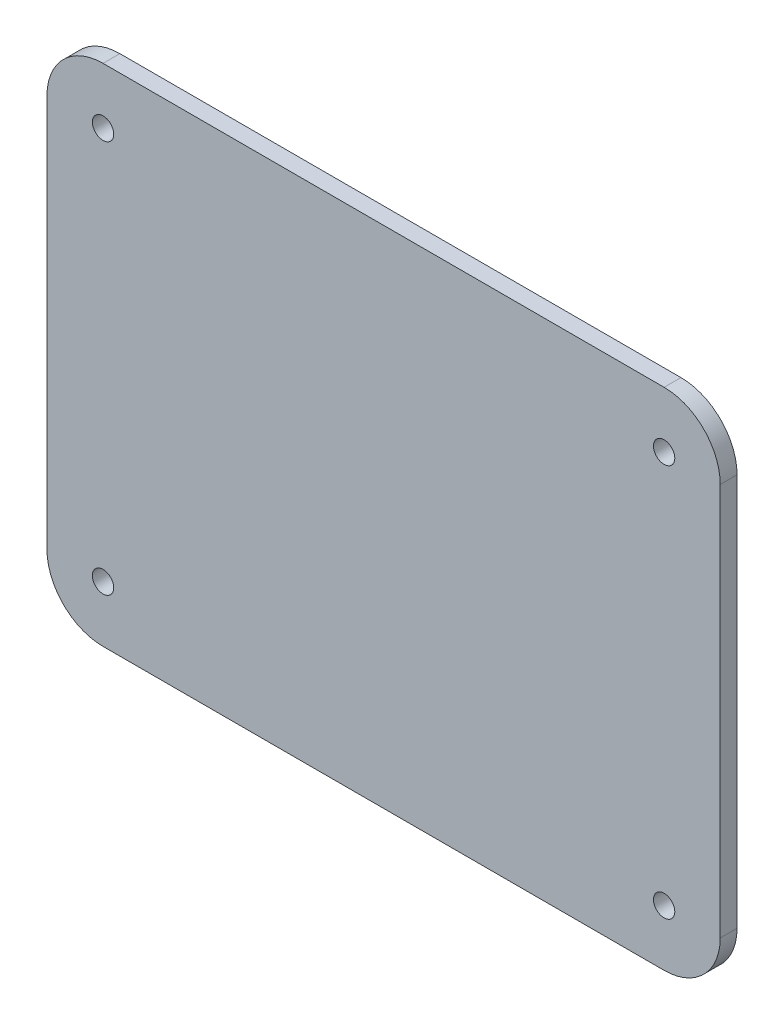
ISO-10303-21;
HEADER;
FILE_DESCRIPTION(('STEP AP214'),'2;1');
FILE_NAME('part.step','',(''),(''),'','','');
FILE_SCHEMA(('AUTOMOTIVE_DESIGN { 1 0 10303 214 1 1 1 1 }'));
ENDSEC;
DATA;
#1=APPLICATION_CONTEXT('core data for automotive mechanical design processes');
#2=APPLICATION_PROTOCOL_DEFINITION('international standard','automotive_design',2000,#1);
#3=PRODUCT_CONTEXT('',#1,'mechanical');
#4=PRODUCT('Part','Part','',(#3));
#5=PRODUCT_RELATED_PRODUCT_CATEGORY('part','',(#4));
#6=PRODUCT_DEFINITION_FORMATION('','',#4);
#7=PRODUCT_DEFINITION_CONTEXT('part definition',#1,'design');
#8=PRODUCT_DEFINITION('design','',#6,#7);
#9=PRODUCT_DEFINITION_SHAPE('','',#8);
#10=(LENGTH_UNIT() NAMED_UNIT(*) SI_UNIT(.MILLI.,.METRE.));
#11=(NAMED_UNIT(*) PLANE_ANGLE_UNIT() SI_UNIT($,.RADIAN.));
#12=(NAMED_UNIT(*) SI_UNIT($,.STERADIAN.) SOLID_ANGLE_UNIT());
#13=UNCERTAINTY_MEASURE_WITH_UNIT(LENGTH_MEASURE(1.E-05),#10,'distance_accuracy_value','');
#14=(GEOMETRIC_REPRESENTATION_CONTEXT(3) GLOBAL_UNCERTAINTY_ASSIGNED_CONTEXT((#13)) GLOBAL_UNIT_ASSIGNED_CONTEXT((#10,
#11,#12)) REPRESENTATION_CONTEXT('',''));
#15=CARTESIAN_POINT('',(0.,0.,0.));
#16=DIRECTION('',(0.,0.,1.));
#17=DIRECTION('',(1.,0.,0.));
#18=AXIS2_PLACEMENT_3D('',#15,#16,#17);
#19=CARTESIAN_POINT('',(-50.,-35.,3.));
#20=DIRECTION('',(0.,0.,1.));
#21=DIRECTION('',(1.,0.,0.));
#22=AXIS2_PLACEMENT_3D('',#19,#20,#21);
#23=PLANE('',#22);
#24=CARTESIAN_POINT('',(50.,-35.,3.));
#25=DIRECTION('',(0.,0.,1.));
#26=DIRECTION('',(1.,0.,0.));
#27=AXIS2_PLACEMENT_3D('',#24,#25,#26);
#28=CIRCLE('',#27,1.9);
#29=CARTESIAN_POINT('',(51.9,-35.,3.));
#30=VERTEX_POINT('',#29);
#31=EDGE_CURVE('E194',#30,#30,#28,.T.);
#32=ORIENTED_EDGE('',*,*,#31,.F.);
#33=EDGE_LOOP('',(#32));
#34=FACE_BOUND('',#33,.T.);
#35=CARTESIAN_POINT('',(-50.,35.,3.));
#36=DIRECTION('',(0.,0.,1.));
#37=DIRECTION('',(1.,0.,0.));
#38=AXIS2_PLACEMENT_3D('',#35,#36,#37);
#39=CIRCLE('',#38,1.9);
#40=CARTESIAN_POINT('',(-48.1,35.,3.));
#41=VERTEX_POINT('',#40);
#42=EDGE_CURVE('E140',#41,#41,#39,.T.);
#43=ORIENTED_EDGE('',*,*,#42,.F.);
#44=EDGE_LOOP('',(#43));
#45=FACE_BOUND('',#44,.T.);
#46=CARTESIAN_POINT('',(-50.,-35.,3.));
#47=DIRECTION('',(0.,0.,1.));
#48=DIRECTION('',(1.,0.,0.));
#49=AXIS2_PLACEMENT_3D('',#46,#47,#48);
#50=CIRCLE('',#49,10.);
#51=CARTESIAN_POINT('',(-60.,-34.9999999999999,3.));
#52=VERTEX_POINT('',#51);
#53=CARTESIAN_POINT('',(-49.9999999999999,-45.,3.));
#54=VERTEX_POINT('',#53);
#55=EDGE_CURVE('E151',#52,#54,#50,.T.);
#56=ORIENTED_EDGE('',*,*,#55,.T.);
#57=DIRECTION('',(1.,0.,0.));
#58=VECTOR('',#57,1.);
#59=CARTESIAN_POINT('',(-49.9999999999999,-45.,3.));
#60=LINE('',#59,#58);
#61=CARTESIAN_POINT('',(50.,-45.,3.));
#62=VERTEX_POINT('',#61);
#63=EDGE_CURVE('E99',#54,#62,#60,.T.);
#64=ORIENTED_EDGE('',*,*,#63,.T.);
#65=CARTESIAN_POINT('',(50.,-35.,3.));
#66=DIRECTION('',(0.,0.,1.));
#67=DIRECTION('',(1.,0.,0.));
#68=AXIS2_PLACEMENT_3D('',#65,#66,#67);
#69=CIRCLE('',#68,10.);
#70=CARTESIAN_POINT('',(60.,-34.9999999999999,3.));
#71=VERTEX_POINT('',#70);
#72=EDGE_CURVE('E166',#62,#71,#69,.T.);
#73=ORIENTED_EDGE('',*,*,#72,.T.);
#74=DIRECTION('',(0.,1.,0.));
#75=VECTOR('',#74,1.);
#76=CARTESIAN_POINT('',(60.,34.9999999999999,3.));
#77=LINE('',#76,#75);
#78=CARTESIAN_POINT('',(60.,34.9999999999999,3.));
#79=VERTEX_POINT('',#78);
#80=EDGE_CURVE('E179',#71,#79,#77,.T.);
#81=ORIENTED_EDGE('',*,*,#80,.T.);
#82=CARTESIAN_POINT('',(50.,35.,3.));
#83=DIRECTION('',(0.,0.,1.));
#84=DIRECTION('',(1.,0.,0.));
#85=AXIS2_PLACEMENT_3D('',#82,#83,#84);
#86=CIRCLE('',#85,10.);
#87=CARTESIAN_POINT('',(49.9999999999999,45.,3.));
#88=VERTEX_POINT('',#87);
#89=EDGE_CURVE('E118',#79,#88,#86,.T.);
#90=ORIENTED_EDGE('',*,*,#89,.T.);
#91=DIRECTION('',(-1.,0.,0.));
#92=VECTOR('',#91,1.);
#93=CARTESIAN_POINT('',(-49.9999999999999,45.,3.));
#94=LINE('',#93,#92);
#95=CARTESIAN_POINT('',(-49.9999999999999,45.,3.));
#96=VERTEX_POINT('',#95);
#97=EDGE_CURVE('E112',#88,#96,#94,.T.);
#98=ORIENTED_EDGE('',*,*,#97,.T.);
#99=CARTESIAN_POINT('',(-50.,35.,3.));
#100=DIRECTION('',(0.,0.,1.));
#101=DIRECTION('',(1.,0.,0.));
#102=AXIS2_PLACEMENT_3D('',#99,#100,#101);
#103=CIRCLE('',#102,10.);
#104=CARTESIAN_POINT('',(-60.,34.9999999999999,3.));
#105=VERTEX_POINT('',#104);
#106=EDGE_CURVE('E116',#96,#105,#103,.T.);
#107=ORIENTED_EDGE('',*,*,#106,.T.);
#108=DIRECTION('',(0.,-1.,0.));
#109=VECTOR('',#108,1.);
#110=CARTESIAN_POINT('',(-60.,34.9999999999999,3.));
#111=LINE('',#110,#109);
#112=EDGE_CURVE('E56',#105,#52,#111,.T.);
#113=ORIENTED_EDGE('',*,*,#112,.T.);
#114=EDGE_LOOP('',(#56,#64,#73,#81,#90,#98,#107,#113));
#115=FACE_BOUND('',#114,.T.);
#116=CARTESIAN_POINT('',(50.,35.,3.));
#117=DIRECTION('',(0.,0.,1.));
#118=DIRECTION('',(1.,0.,0.));
#119=AXIS2_PLACEMENT_3D('',#116,#117,#118);
#120=CIRCLE('',#119,1.9);
#121=CARTESIAN_POINT('',(51.9,35.,3.));
#122=VERTEX_POINT('',#121);
#123=EDGE_CURVE('E188',#122,#122,#120,.T.);
#124=ORIENTED_EDGE('',*,*,#123,.F.);
#125=EDGE_LOOP('',(#124));
#126=FACE_BOUND('',#125,.T.);
#127=CARTESIAN_POINT('',(-50.,-35.,3.));
#128=DIRECTION('',(0.,0.,1.));
#129=DIRECTION('',(1.,0.,0.));
#130=AXIS2_PLACEMENT_3D('',#127,#128,#129);
#131=CIRCLE('',#130,1.9);
#132=CARTESIAN_POINT('',(-48.1,-35.,3.));
#133=VERTEX_POINT('',#132);
#134=EDGE_CURVE('E200',#133,#133,#131,.T.);
#135=ORIENTED_EDGE('',*,*,#134,.F.);
#136=EDGE_LOOP('',(#135));
#137=FACE_BOUND('',#136,.T.);
#138=ADVANCED_FACE('F39',(#34,#45,#115,#126,#137),#23,.T.);
#139=CARTESIAN_POINT('',(-50.,-35.,0.));
#140=DIRECTION('',(0.,0.,1.));
#141=DIRECTION('',(1.,0.,0.));
#142=AXIS2_PLACEMENT_3D('',#139,#140,#141);
#143=PLANE('',#142);
#144=CARTESIAN_POINT('',(-50.,-35.,0.));
#145=DIRECTION('',(0.,0.,1.));
#146=DIRECTION('',(1.,0.,0.));
#147=AXIS2_PLACEMENT_3D('',#144,#145,#146);
#148=CIRCLE('',#147,10.);
#149=CARTESIAN_POINT('',(-60.,-34.9999999999999,0.));
#150=VERTEX_POINT('',#149);
#151=CARTESIAN_POINT('',(-49.9999999999999,-45.,0.));
#152=VERTEX_POINT('',#151);
#153=EDGE_CURVE('E136',#150,#152,#148,.T.);
#154=ORIENTED_EDGE('',*,*,#153,.F.);
#155=DIRECTION('',(0.,-1.,0.));
#156=VECTOR('',#155,1.);
#157=CARTESIAN_POINT('',(-60.,34.9999999999999,0.));
#158=LINE('',#157,#156);
#159=CARTESIAN_POINT('',(-60.,34.9999999999999,0.));
#160=VERTEX_POINT('',#159);
#161=EDGE_CURVE('E91',#160,#150,#158,.T.);
#162=ORIENTED_EDGE('',*,*,#161,.F.);
#163=CARTESIAN_POINT('',(-50.,35.,0.));
#164=DIRECTION('',(0.,0.,1.));
#165=DIRECTION('',(1.,0.,0.));
#166=AXIS2_PLACEMENT_3D('',#163,#164,#165);
#167=CIRCLE('',#166,10.);
#168=CARTESIAN_POINT('',(-49.9999999999999,45.,0.));
#169=VERTEX_POINT('',#168);
#170=EDGE_CURVE('E85',#169,#160,#167,.T.);
#171=ORIENTED_EDGE('',*,*,#170,.F.);
#172=DIRECTION('',(-1.,0.,0.));
#173=VECTOR('',#172,1.);
#174=CARTESIAN_POINT('',(-49.9999999999999,45.,0.));
#175=LINE('',#174,#173);
#176=CARTESIAN_POINT('',(49.9999999999999,45.,0.));
#177=VERTEX_POINT('',#176);
#178=EDGE_CURVE('E126',#177,#169,#175,.T.);
#179=ORIENTED_EDGE('',*,*,#178,.F.);
#180=CARTESIAN_POINT('',(50.,35.,0.));
#181=DIRECTION('',(0.,0.,1.));
#182=DIRECTION('',(1.,0.,0.));
#183=AXIS2_PLACEMENT_3D('',#180,#181,#182);
#184=CIRCLE('',#183,10.);
#185=CARTESIAN_POINT('',(60.,34.9999999999999,0.));
#186=VERTEX_POINT('',#185);
#187=EDGE_CURVE('E146',#186,#177,#184,.T.);
#188=ORIENTED_EDGE('',*,*,#187,.F.);
#189=DIRECTION('',(0.,1.,0.));
#190=VECTOR('',#189,1.);
#191=CARTESIAN_POINT('',(60.,34.9999999999999,0.));
#192=LINE('',#191,#190);
#193=CARTESIAN_POINT('',(60.,-34.9999999999999,0.));
#194=VERTEX_POINT('',#193);
#195=EDGE_CURVE('E144',#194,#186,#192,.T.);
#196=ORIENTED_EDGE('',*,*,#195,.F.);
#197=CARTESIAN_POINT('',(50.,-35.,0.));
#198=DIRECTION('',(0.,0.,1.));
#199=DIRECTION('',(1.,0.,0.));
#200=AXIS2_PLACEMENT_3D('',#197,#198,#199);
#201=CIRCLE('',#200,10.);
#202=CARTESIAN_POINT('',(50.,-45.,0.));
#203=VERTEX_POINT('',#202);
#204=EDGE_CURVE('E142',#203,#194,#201,.T.);
#205=ORIENTED_EDGE('',*,*,#204,.F.);
#206=DIRECTION('',(1.,0.,0.));
#207=VECTOR('',#206,1.);
#208=CARTESIAN_POINT('',(-49.9999999999999,-45.,0.));
#209=LINE('',#208,#207);
#210=EDGE_CURVE('E139',#152,#203,#209,.T.);
#211=ORIENTED_EDGE('',*,*,#210,.F.);
#212=EDGE_LOOP('',(#154,#162,#171,#179,#188,#196,#205,#211));
#213=FACE_BOUND('',#212,.T.);
#214=CARTESIAN_POINT('',(-50.,35.,0.));
#215=DIRECTION('',(0.,0.,1.));
#216=DIRECTION('',(1.,0.,0.));
#217=AXIS2_PLACEMENT_3D('',#214,#215,#216);
#218=CIRCLE('',#217,1.9);
#219=CARTESIAN_POINT('',(-48.1,35.,0.));
#220=VERTEX_POINT('',#219);
#221=EDGE_CURVE('E185',#220,#220,#218,.T.);
#222=ORIENTED_EDGE('',*,*,#221,.T.);
#223=EDGE_LOOP('',(#222));
#224=FACE_BOUND('',#223,.T.);
#225=CARTESIAN_POINT('',(50.,35.,0.));
#226=DIRECTION('',(0.,0.,1.));
#227=DIRECTION('',(1.,0.,0.));
#228=AXIS2_PLACEMENT_3D('',#225,#226,#227);
#229=CIRCLE('',#228,1.9);
#230=CARTESIAN_POINT('',(51.9,35.,0.));
#231=VERTEX_POINT('',#230);
#232=EDGE_CURVE('E191',#231,#231,#229,.T.);
#233=ORIENTED_EDGE('',*,*,#232,.T.);
#234=EDGE_LOOP('',(#233));
#235=FACE_BOUND('',#234,.T.);
#236=CARTESIAN_POINT('',(50.,-35.,0.));
#237=DIRECTION('',(0.,0.,1.));
#238=DIRECTION('',(1.,0.,0.));
#239=AXIS2_PLACEMENT_3D('',#236,#237,#238);
#240=CIRCLE('',#239,1.9);
#241=CARTESIAN_POINT('',(51.9,-35.,0.));
#242=VERTEX_POINT('',#241);
#243=EDGE_CURVE('E197',#242,#242,#240,.T.);
#244=ORIENTED_EDGE('',*,*,#243,.T.);
#245=EDGE_LOOP('',(#244));
#246=FACE_BOUND('',#245,.T.);
#247=CARTESIAN_POINT('',(-50.,-35.,0.));
#248=DIRECTION('',(0.,0.,1.));
#249=DIRECTION('',(1.,0.,0.));
#250=AXIS2_PLACEMENT_3D('',#247,#248,#249);
#251=CIRCLE('',#250,1.9);
#252=CARTESIAN_POINT('',(-48.1,-35.,0.));
#253=VERTEX_POINT('',#252);
#254=EDGE_CURVE('E203',#253,#253,#251,.T.);
#255=ORIENTED_EDGE('',*,*,#254,.T.);
#256=EDGE_LOOP('',(#255));
#257=FACE_BOUND('',#256,.T.);
#258=ADVANCED_FACE('F170',(#213,#224,#235,#246,#257),#143,.F.);
#259=CARTESIAN_POINT('',(-50.,-35.,3.));
#260=DIRECTION('',(0.,0.,-1.));
#261=DIRECTION('',(-1.,0.,0.));
#262=AXIS2_PLACEMENT_3D('',#259,#260,#261);
#263=CYLINDRICAL_SURFACE('',#262,10.);
#264=ORIENTED_EDGE('',*,*,#153,.T.);
#265=DIRECTION('',(0.,0.,-1.));
#266=VECTOR('',#265,1.);
#267=CARTESIAN_POINT('',(-49.9999999999999,-45.,3.));
#268=LINE('',#267,#266);
#269=EDGE_CURVE('E11',#54,#152,#268,.T.);
#270=ORIENTED_EDGE('',*,*,#269,.F.);
#271=ORIENTED_EDGE('',*,*,#55,.F.);
#272=DIRECTION('',(0.,0.,-1.));
#273=VECTOR('',#272,1.);
#274=CARTESIAN_POINT('',(-60.,-34.9999999999999,3.));
#275=LINE('',#274,#273);
#276=EDGE_CURVE('E132',#52,#150,#275,.T.);
#277=ORIENTED_EDGE('',*,*,#276,.T.);
#278=EDGE_LOOP('',(#264,#270,#271,#277));
#279=FACE_BOUND('',#278,.T.);
#280=ADVANCED_FACE('F41',(#279),#263,.T.);
#281=CARTESIAN_POINT('',(-49.9999999999999,-45.,3.));
#282=DIRECTION('',(0.,1.,0.));
#283=DIRECTION('',(0.,0.,1.));
#284=AXIS2_PLACEMENT_3D('',#281,#282,#283);
#285=PLANE('',#284);
#286=ORIENTED_EDGE('',*,*,#210,.T.);
#287=DIRECTION('',(0.,0.,-1.));
#288=VECTOR('',#287,1.);
#289=CARTESIAN_POINT('',(50.,-45.,3.));
#290=LINE('',#289,#288);
#291=EDGE_CURVE('E48',#62,#203,#290,.T.);
#292=ORIENTED_EDGE('',*,*,#291,.F.);
#293=ORIENTED_EDGE('',*,*,#63,.F.);
#294=ORIENTED_EDGE('',*,*,#269,.T.);
#295=EDGE_LOOP('',(#286,#292,#293,#294));
#296=FACE_BOUND('',#295,.T.);
#297=ADVANCED_FACE('F237',(#296),#285,.F.);
#298=CARTESIAN_POINT('',(50.,-35.,3.));
#299=DIRECTION('',(0.,0.,-1.));
#300=DIRECTION('',(-1.,0.,0.));
#301=AXIS2_PLACEMENT_3D('',#298,#299,#300);
#302=CYLINDRICAL_SURFACE('',#301,10.);
#303=ORIENTED_EDGE('',*,*,#204,.T.);
#304=DIRECTION('',(0.,0.,-1.));
#305=VECTOR('',#304,1.);
#306=CARTESIAN_POINT('',(60.,-34.9999999999999,3.));
#307=LINE('',#306,#305);
#308=EDGE_CURVE('E158',#71,#194,#307,.T.);
#309=ORIENTED_EDGE('',*,*,#308,.F.);
#310=ORIENTED_EDGE('',*,*,#72,.F.);
#311=ORIENTED_EDGE('',*,*,#291,.T.);
#312=EDGE_LOOP('',(#303,#309,#310,#311));
#313=FACE_BOUND('',#312,.T.);
#314=ADVANCED_FACE('F164',(#313),#302,.T.);
#315=CARTESIAN_POINT('',(60.,34.9999999999999,3.));
#316=DIRECTION('',(-1.,0.,0.));
#317=DIRECTION('',(0.,-1.,0.));
#318=AXIS2_PLACEMENT_3D('',#315,#316,#317);
#319=PLANE('',#318);
#320=ORIENTED_EDGE('',*,*,#195,.T.);
#321=DIRECTION('',(0.,0.,-1.));
#322=VECTOR('',#321,1.);
#323=CARTESIAN_POINT('',(60.,34.9999999999999,3.));
#324=LINE('',#323,#322);
#325=EDGE_CURVE('E155',#79,#186,#324,.T.);
#326=ORIENTED_EDGE('',*,*,#325,.F.);
#327=ORIENTED_EDGE('',*,*,#80,.F.);
#328=ORIENTED_EDGE('',*,*,#308,.T.);
#329=EDGE_LOOP('',(#320,#326,#327,#328));
#330=FACE_BOUND('',#329,.T.);
#331=ADVANCED_FACE('F175',(#330),#319,.F.);
#332=CARTESIAN_POINT('',(50.,35.,3.));
#333=DIRECTION('',(0.,0.,-1.));
#334=DIRECTION('',(-1.,0.,0.));
#335=AXIS2_PLACEMENT_3D('',#332,#333,#334);
#336=CYLINDRICAL_SURFACE('',#335,10.);
#337=ORIENTED_EDGE('',*,*,#187,.T.);
#338=DIRECTION('',(0.,0.,-1.));
#339=VECTOR('',#338,1.);
#340=CARTESIAN_POINT('',(49.9999999999999,45.,3.));
#341=LINE('',#340,#339);
#342=EDGE_CURVE('E127',#88,#177,#341,.T.);
#343=ORIENTED_EDGE('',*,*,#342,.F.);
#344=ORIENTED_EDGE('',*,*,#89,.F.);
#345=ORIENTED_EDGE('',*,*,#325,.T.);
#346=EDGE_LOOP('',(#337,#343,#344,#345));
#347=FACE_BOUND('',#346,.T.);
#348=ADVANCED_FACE('F178',(#347),#336,.T.);
#349=CARTESIAN_POINT('',(-49.9999999999999,45.,3.));
#350=DIRECTION('',(0.,-1.,0.));
#351=DIRECTION('',(0.,0.,-1.));
#352=AXIS2_PLACEMENT_3D('',#349,#350,#351);
#353=PLANE('',#352);
#354=ORIENTED_EDGE('',*,*,#178,.T.);
#355=DIRECTION('',(0.,0.,-1.));
#356=VECTOR('',#355,1.);
#357=CARTESIAN_POINT('',(-49.9999999999999,45.,3.));
#358=LINE('',#357,#356);
#359=EDGE_CURVE('E123',#96,#169,#358,.T.);
#360=ORIENTED_EDGE('',*,*,#359,.F.);
#361=ORIENTED_EDGE('',*,*,#97,.F.);
#362=ORIENTED_EDGE('',*,*,#342,.T.);
#363=EDGE_LOOP('',(#354,#360,#361,#362));
#364=FACE_BOUND('',#363,.T.);
#365=ADVANCED_FACE('F124',(#364),#353,.F.);
#366=CARTESIAN_POINT('',(-50.,35.,3.));
#367=DIRECTION('',(0.,0.,-1.));
#368=DIRECTION('',(-1.,0.,0.));
#369=AXIS2_PLACEMENT_3D('',#366,#367,#368);
#370=CYLINDRICAL_SURFACE('',#369,10.);
#371=ORIENTED_EDGE('',*,*,#170,.T.);
#372=DIRECTION('',(0.,0.,-1.));
#373=VECTOR('',#372,1.);
#374=CARTESIAN_POINT('',(-60.,34.9999999999999,3.));
#375=LINE('',#374,#373);
#376=EDGE_CURVE('E128',#105,#160,#375,.T.);
#377=ORIENTED_EDGE('',*,*,#376,.F.);
#378=ORIENTED_EDGE('',*,*,#106,.F.);
#379=ORIENTED_EDGE('',*,*,#359,.T.);
#380=EDGE_LOOP('',(#371,#377,#378,#379));
#381=FACE_BOUND('',#380,.T.);
#382=ADVANCED_FACE('F130',(#381),#370,.T.);
#383=CARTESIAN_POINT('',(-60.,34.9999999999999,3.));
#384=DIRECTION('',(1.,0.,0.));
#385=DIRECTION('',(0.,1.,0.));
#386=AXIS2_PLACEMENT_3D('',#383,#384,#385);
#387=PLANE('',#386);
#388=ORIENTED_EDGE('',*,*,#161,.T.);
#389=ORIENTED_EDGE('',*,*,#276,.F.);
#390=ORIENTED_EDGE('',*,*,#112,.F.);
#391=ORIENTED_EDGE('',*,*,#376,.T.);
#392=EDGE_LOOP('',(#388,#389,#390,#391));
#393=FACE_BOUND('',#392,.T.);
#394=ADVANCED_FACE('F225',(#393),#387,.F.);
#395=CARTESIAN_POINT('',(-50.,35.,3.));
#396=DIRECTION('',(0.,0.,-1.));
#397=DIRECTION('',(-1.,0.,0.));
#398=AXIS2_PLACEMENT_3D('',#395,#396,#397);
#399=CYLINDRICAL_SURFACE('',#398,1.9);
#400=ORIENTED_EDGE('',*,*,#42,.T.);
#401=EDGE_LOOP('',(#400));
#402=FACE_BOUND('',#401,.T.);
#403=ORIENTED_EDGE('',*,*,#221,.F.);
#404=EDGE_LOOP('',(#403));
#405=FACE_BOUND('',#404,.T.);
#406=ADVANCED_FACE('F222',(#402,#405),#399,.F.);
#407=CARTESIAN_POINT('',(50.,35.,3.));
#408=DIRECTION('',(0.,0.,-1.));
#409=DIRECTION('',(-1.,0.,0.));
#410=AXIS2_PLACEMENT_3D('',#407,#408,#409);
#411=CYLINDRICAL_SURFACE('',#410,1.9);
#412=ORIENTED_EDGE('',*,*,#123,.T.);
#413=EDGE_LOOP('',(#412));
#414=FACE_BOUND('',#413,.T.);
#415=ORIENTED_EDGE('',*,*,#232,.F.);
#416=EDGE_LOOP('',(#415));
#417=FACE_BOUND('',#416,.T.);
#418=ADVANCED_FACE('F300',(#414,#417),#411,.F.);
#419=CARTESIAN_POINT('',(50.,-35.,3.));
#420=DIRECTION('',(0.,0.,-1.));
#421=DIRECTION('',(-1.,0.,0.));
#422=AXIS2_PLACEMENT_3D('',#419,#420,#421);
#423=CYLINDRICAL_SURFACE('',#422,1.9);
#424=ORIENTED_EDGE('',*,*,#31,.T.);
#425=EDGE_LOOP('',(#424));
#426=FACE_BOUND('',#425,.T.);
#427=ORIENTED_EDGE('',*,*,#243,.F.);
#428=EDGE_LOOP('',(#427));
#429=FACE_BOUND('',#428,.T.);
#430=ADVANCED_FACE('F308',(#426,#429),#423,.F.);
#431=CARTESIAN_POINT('',(-50.,-35.,3.));
#432=DIRECTION('',(0.,0.,-1.));
#433=DIRECTION('',(-1.,0.,0.));
#434=AXIS2_PLACEMENT_3D('',#431,#432,#433);
#435=CYLINDRICAL_SURFACE('',#434,1.9);
#436=ORIENTED_EDGE('',*,*,#134,.T.);
#437=EDGE_LOOP('',(#436));
#438=FACE_BOUND('',#437,.T.);
#439=ORIENTED_EDGE('',*,*,#254,.F.);
#440=EDGE_LOOP('',(#439));
#441=FACE_BOUND('',#440,.T.);
#442=ADVANCED_FACE('F209',(#438,#441),#435,.F.);
#443=CLOSED_SHELL('',(#138,#258,#280,#297,#314,#331,#348,#365,#382,#394,#406,#418,#430,#442));
#444=MANIFOLD_SOLID_BREP('B2',#443);
#445=ADVANCED_BREP_SHAPE_REPRESENTATION('',(#18,#444),#14);
#446=SHAPE_DEFINITION_REPRESENTATION(#9,#445);
ENDSEC;
END-ISO-10303-21;
